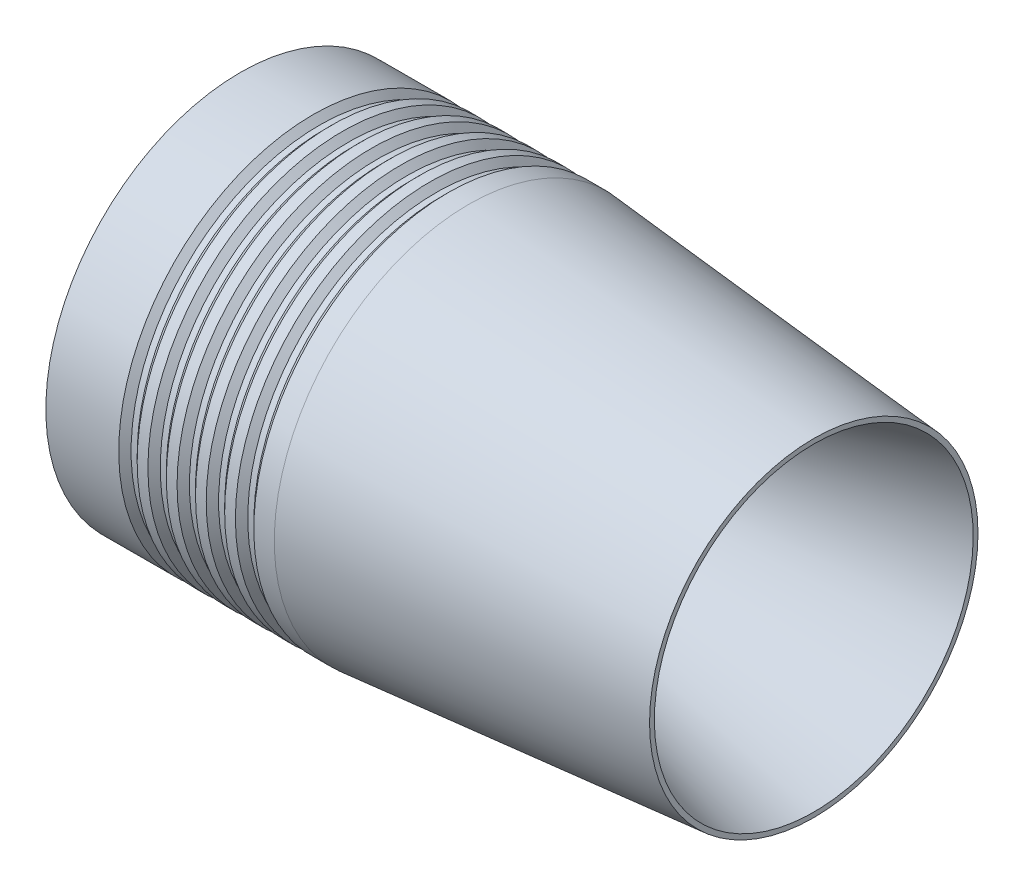
ISO-10303-21;
HEADER;
FILE_DESCRIPTION(('STEP AP214'),'2;1');
FILE_NAME('part.step','',(''),(''),'','','');
FILE_SCHEMA(('AUTOMOTIVE_DESIGN { 1 0 10303 214 1 1 1 1 }'));
ENDSEC;
DATA;
#1=APPLICATION_CONTEXT('core data for automotive mechanical design processes');
#2=APPLICATION_PROTOCOL_DEFINITION('international standard','automotive_design',2000,#1);
#3=PRODUCT_CONTEXT('',#1,'mechanical');
#4=PRODUCT('Part','Part','',(#3));
#5=PRODUCT_RELATED_PRODUCT_CATEGORY('part','',(#4));
#6=PRODUCT_DEFINITION_FORMATION('','',#4);
#7=PRODUCT_DEFINITION_CONTEXT('part definition',#1,'design');
#8=PRODUCT_DEFINITION('design','',#6,#7);
#9=PRODUCT_DEFINITION_SHAPE('','',#8);
#10=(LENGTH_UNIT() NAMED_UNIT(*) SI_UNIT(.MILLI.,.METRE.));
#11=(NAMED_UNIT(*) PLANE_ANGLE_UNIT() SI_UNIT($,.RADIAN.));
#12=(NAMED_UNIT(*) SI_UNIT($,.STERADIAN.) SOLID_ANGLE_UNIT());
#13=UNCERTAINTY_MEASURE_WITH_UNIT(LENGTH_MEASURE(1.E-05),#10,'distance_accuracy_value','');
#14=(GEOMETRIC_REPRESENTATION_CONTEXT(3) GLOBAL_UNCERTAINTY_ASSIGNED_CONTEXT((#13)) GLOBAL_UNIT_ASSIGNED_CONTEXT((#10,
#11,#12)) REPRESENTATION_CONTEXT('',''));
#15=CARTESIAN_POINT('',(0.,0.,0.));
#16=DIRECTION('',(0.,0.,1.));
#17=DIRECTION('',(1.,0.,0.));
#18=AXIS2_PLACEMENT_3D('',#15,#16,#17);
#19=CARTESIAN_POINT('',(0.,0.,0.));
#20=DIRECTION('',(1.,0.,0.));
#21=DIRECTION('',(0.,1.,0.));
#22=AXIS2_PLACEMENT_3D('',#19,#20,#21);
#23=CYLINDRICAL_SURFACE('',#22,50.8);
#24=CARTESIAN_POINT('',(-12.9667000000001,0.,0.));
#25=DIRECTION('',(1.,0.,0.));
#26=DIRECTION('',(0.,0.,-1.));
#27=AXIS2_PLACEMENT_3D('',#24,#25,#26);
#28=CIRCLE('',#27,50.8);
#29=CARTESIAN_POINT('',(-12.9667000000001,0.,-50.8));
#30=VERTEX_POINT('',#29);
#31=EDGE_CURVE('E133',#30,#30,#28,.T.);
#32=ORIENTED_EDGE('',*,*,#31,.T.);
#33=EDGE_LOOP('',(#32));
#34=FACE_BOUND('',#33,.T.);
#35=CARTESIAN_POINT('',(-10.16,0.,0.));
#36=DIRECTION('',(1.,0.,0.));
#37=DIRECTION('',(0.,0.,-1.));
#38=AXIS2_PLACEMENT_3D('',#35,#36,#37);
#39=CIRCLE('',#38,50.8);
#40=CARTESIAN_POINT('',(-10.16,0.,-50.8));
#41=VERTEX_POINT('',#40);
#42=EDGE_CURVE('E153',#41,#41,#39,.T.);
#43=ORIENTED_EDGE('',*,*,#42,.F.);
#44=EDGE_LOOP('',(#43));
#45=FACE_BOUND('',#44,.T.);
#46=ADVANCED_FACE('F41',(#34,#45),#23,.T.);
#47=CARTESIAN_POINT('',(-20.5867000000001,0.,0.));
#48=DIRECTION('',(1.,0.,0.));
#49=DIRECTION('',(0.,0.,-1.));
#50=AXIS2_PLACEMENT_3D('',#47,#48,#49);
#51=CIRCLE('',#50,50.8);
#52=CARTESIAN_POINT('',(-20.5867000000001,0.,-50.8));
#53=VERTEX_POINT('',#52);
#54=EDGE_CURVE('E117',#53,#53,#51,.T.);
#55=ORIENTED_EDGE('',*,*,#54,.T.);
#56=EDGE_LOOP('',(#55));
#57=FACE_BOUND('',#56,.T.);
#58=CARTESIAN_POINT('',(-17.78,0.,0.));
#59=DIRECTION('',(1.,0.,0.));
#60=DIRECTION('',(0.,0.,-1.));
#61=AXIS2_PLACEMENT_3D('',#58,#59,#60);
#62=CIRCLE('',#61,50.8);
#63=CARTESIAN_POINT('',(-17.78,0.,-50.8));
#64=VERTEX_POINT('',#63);
#65=EDGE_CURVE('E137',#64,#64,#62,.T.);
#66=ORIENTED_EDGE('',*,*,#65,.F.);
#67=EDGE_LOOP('',(#66));
#68=FACE_BOUND('',#67,.T.);
#69=ADVANCED_FACE('F179',(#57,#68),#23,.T.);
#70=CARTESIAN_POINT('',(-28.2067000000001,0.,0.));
#71=DIRECTION('',(1.,0.,0.));
#72=DIRECTION('',(0.,0.,-1.));
#73=AXIS2_PLACEMENT_3D('',#70,#71,#72);
#74=CIRCLE('',#73,50.8);
#75=CARTESIAN_POINT('',(-28.2067000000001,0.,-50.8));
#76=VERTEX_POINT('',#75);
#77=EDGE_CURVE('E101',#76,#76,#74,.T.);
#78=ORIENTED_EDGE('',*,*,#77,.T.);
#79=EDGE_LOOP('',(#78));
#80=FACE_BOUND('',#79,.T.);
#81=CARTESIAN_POINT('',(-25.4,0.,0.));
#82=DIRECTION('',(1.,0.,0.));
#83=DIRECTION('',(0.,0.,-1.));
#84=AXIS2_PLACEMENT_3D('',#81,#82,#83);
#85=CIRCLE('',#84,50.8);
#86=CARTESIAN_POINT('',(-25.4,0.,-50.8));
#87=VERTEX_POINT('',#86);
#88=EDGE_CURVE('E121',#87,#87,#85,.T.);
#89=ORIENTED_EDGE('',*,*,#88,.F.);
#90=EDGE_LOOP('',(#89));
#91=FACE_BOUND('',#90,.T.);
#92=ADVANCED_FACE('F185',(#80,#91),#23,.T.);
#93=CARTESIAN_POINT('',(-35.8267000000001,0.,0.));
#94=DIRECTION('',(1.,0.,0.));
#95=DIRECTION('',(0.,0.,-1.));
#96=AXIS2_PLACEMENT_3D('',#93,#94,#95);
#97=CIRCLE('',#96,50.8);
#98=CARTESIAN_POINT('',(-35.8267000000001,0.,-50.8));
#99=VERTEX_POINT('',#98);
#100=EDGE_CURVE('E85',#99,#99,#97,.T.);
#101=ORIENTED_EDGE('',*,*,#100,.T.);
#102=EDGE_LOOP('',(#101));
#103=FACE_BOUND('',#102,.T.);
#104=CARTESIAN_POINT('',(-33.02,0.,0.));
#105=DIRECTION('',(1.,0.,0.));
#106=DIRECTION('',(0.,0.,-1.));
#107=AXIS2_PLACEMENT_3D('',#104,#105,#106);
#108=CIRCLE('',#107,50.8);
#109=CARTESIAN_POINT('',(-33.02,0.,-50.8));
#110=VERTEX_POINT('',#109);
#111=EDGE_CURVE('E105',#110,#110,#108,.T.);
#112=ORIENTED_EDGE('',*,*,#111,.F.);
#113=EDGE_LOOP('',(#112));
#114=FACE_BOUND('',#113,.T.);
#115=ADVANCED_FACE('F202',(#103,#114),#23,.T.);
#116=CARTESIAN_POINT('',(-59.69,0.,0.));
#117=DIRECTION('',(1.,0.,0.));
#118=DIRECTION('',(0.,1.,0.));
#119=AXIS2_PLACEMENT_3D('',#116,#117,#118);
#120=CIRCLE('',#119,50.8);
#121=CARTESIAN_POINT('',(-59.69,50.8,0.));
#122=VERTEX_POINT('',#121);
#123=EDGE_CURVE('E50',#122,#122,#120,.T.);
#124=ORIENTED_EDGE('',*,*,#123,.T.);
#125=EDGE_LOOP('',(#124));
#126=FACE_BOUND('',#125,.T.);
#127=CARTESIAN_POINT('',(-40.64,0.,0.));
#128=DIRECTION('',(1.,0.,0.));
#129=DIRECTION('',(0.,0.,-1.));
#130=AXIS2_PLACEMENT_3D('',#127,#128,#129);
#131=CIRCLE('',#130,50.8);
#132=CARTESIAN_POINT('',(-40.64,0.,-50.8));
#133=VERTEX_POINT('',#132);
#134=EDGE_CURVE('E89',#133,#133,#131,.T.);
#135=ORIENTED_EDGE('',*,*,#134,.F.);
#136=EDGE_LOOP('',(#135));
#137=FACE_BOUND('',#136,.T.);
#138=ADVANCED_FACE('F192',(#126,#137),#23,.T.);
#139=CARTESIAN_POINT('',(0.,0.,0.));
#140=DIRECTION('',(-1.,0.,0.));
#141=DIRECTION('',(0.,-1.,0.));
#142=AXIS2_PLACEMENT_3D('',#139,#140,#141);
#143=CONICAL_SURFACE('',#142,50.8,0.0872664625997168);
#144=CARTESIAN_POINT('',(90.17,0.,0.));
#145=DIRECTION('',(1.,0.,0.));
#146=DIRECTION('',(0.,1.,0.));
#147=AXIS2_PLACEMENT_3D('',#144,#145,#146);
#148=CIRCLE('',#147,42.9111472098674);
#149=CARTESIAN_POINT('',(90.17,42.9111472098674,0.));
#150=VERTEX_POINT('',#149);
#151=EDGE_CURVE('E61',#150,#150,#148,.T.);
#152=ORIENTED_EDGE('',*,*,#151,.F.);
#153=EDGE_LOOP('',(#152));
#154=FACE_BOUND('',#153,.T.);
#155=CARTESIAN_POINT('',(0.,0.,0.));
#156=DIRECTION('',(1.,0.,0.));
#157=DIRECTION('',(0.,1.,0.));
#158=AXIS2_PLACEMENT_3D('',#155,#156,#157);
#159=CIRCLE('',#158,50.8);
#160=CARTESIAN_POINT('',(0.,50.8,0.));
#161=VERTEX_POINT('',#160);
#162=EDGE_CURVE('E10',#161,#161,#159,.T.);
#163=ORIENTED_EDGE('',*,*,#162,.T.);
#164=EDGE_LOOP('',(#163));
#165=FACE_BOUND('',#164,.T.);
#166=ADVANCED_FACE('F43',(#154,#165),#143,.T.);
#167=CARTESIAN_POINT('',(-5.34670000000008,0.,0.));
#168=DIRECTION('',(1.,0.,0.));
#169=DIRECTION('',(0.,0.,-1.));
#170=AXIS2_PLACEMENT_3D('',#167,#168,#169);
#171=CIRCLE('',#170,50.8);
#172=CARTESIAN_POINT('',(-5.34670000000008,0.,-50.8));
#173=VERTEX_POINT('',#172);
#174=EDGE_CURVE('E149',#173,#173,#171,.T.);
#175=ORIENTED_EDGE('',*,*,#174,.T.);
#176=EDGE_LOOP('',(#175));
#177=FACE_BOUND('',#176,.T.);
#178=ORIENTED_EDGE('',*,*,#162,.F.);
#179=EDGE_LOOP('',(#178));
#180=FACE_BOUND('',#179,.T.);
#181=ADVANCED_FACE('F181',(#177,#180),#23,.T.);
#182=CARTESIAN_POINT('',(-59.69,0.,0.));
#183=DIRECTION('',(1.,0.,0.));
#184=DIRECTION('',(0.,1.,0.));
#185=AXIS2_PLACEMENT_3D('',#182,#183,#184);
#186=PLANE('',#185);
#187=ORIENTED_EDGE('',*,*,#123,.F.);
#188=EDGE_LOOP('',(#187));
#189=FACE_BOUND('',#188,.T.);
#190=CARTESIAN_POINT('',(-59.69,0.,0.));
#191=DIRECTION('',(1.,0.,0.));
#192=DIRECTION('',(0.,1.,0.));
#193=AXIS2_PLACEMENT_3D('',#190,#191,#192);
#194=CIRCLE('',#193,44.45);
#195=CARTESIAN_POINT('',(-59.69,44.45,0.));
#196=VERTEX_POINT('',#195);
#197=EDGE_CURVE('E73',#196,#196,#194,.T.);
#198=ORIENTED_EDGE('',*,*,#197,.T.);
#199=EDGE_LOOP('',(#198));
#200=FACE_BOUND('',#199,.T.);
#201=ADVANCED_FACE('F190',(#189,#200),#186,.F.);
#202=CARTESIAN_POINT('',(1.78084856857237,0.,0.));
#203=DIRECTION('',(1.,0.,0.));
#204=DIRECTION('',(0.,1.,0.));
#205=AXIS2_PLACEMENT_3D('',#202,#203,#204);
#206=CONICAL_SURFACE('',#205,17.8882556763972,0.262685253079923);
#207=CARTESIAN_POINT('',(25.4,0.,0.));
#208=DIRECTION('',(1.,0.,0.));
#209=DIRECTION('',(0.,1.,0.));
#210=AXIS2_PLACEMENT_3D('',#207,#208,#209);
#211=CIRCLE('',#210,24.2394191763448);
#212=CARTESIAN_POINT('',(25.4,24.2394191763448,0.));
#213=VERTEX_POINT('',#212);
#214=EDGE_CURVE('E45',#213,#213,#211,.T.);
#215=ORIENTED_EDGE('',*,*,#214,.F.);
#216=EDGE_LOOP('',(#215));
#217=FACE_BOUND('',#216,.T.);
#218=CARTESIAN_POINT('',(90.17,0.,0.));
#219=DIRECTION('',(1.,0.,0.));
#220=DIRECTION('',(0.,1.,0.));
#221=AXIS2_PLACEMENT_3D('',#218,#219,#220);
#222=CIRCLE('',#221,41.656);
#223=CARTESIAN_POINT('',(90.17,41.656,0.));
#224=VERTEX_POINT('',#223);
#225=EDGE_CURVE('E55',#224,#224,#222,.T.);
#226=ORIENTED_EDGE('',*,*,#225,.T.);
#227=EDGE_LOOP('',(#226));
#228=FACE_BOUND('',#227,.T.);
#229=ADVANCED_FACE('F197',(#217,#228),#206,.F.);
#230=CARTESIAN_POINT('',(90.17,0.,0.));
#231=DIRECTION('',(1.,0.,0.));
#232=DIRECTION('',(0.,1.,0.));
#233=AXIS2_PLACEMENT_3D('',#230,#231,#232);
#234=PLANE('',#233);
#235=ORIENTED_EDGE('',*,*,#151,.T.);
#236=EDGE_LOOP('',(#235));
#237=FACE_BOUND('',#236,.T.);
#238=ORIENTED_EDGE('',*,*,#225,.F.);
#239=EDGE_LOOP('',(#238));
#240=FACE_BOUND('',#239,.T.);
#241=ADVANCED_FACE('F252',(#237,#240),#234,.T.);
#242=CARTESIAN_POINT('',(25.4,0.,0.));
#243=DIRECTION('',(1.,0.,0.));
#244=DIRECTION('',(0.,1.,0.));
#245=AXIS2_PLACEMENT_3D('',#242,#243,#244);
#246=PLANE('',#245);
#247=ORIENTED_EDGE('',*,*,#214,.T.);
#248=EDGE_LOOP('',(#247));
#249=FACE_BOUND('',#248,.T.);
#250=CARTESIAN_POINT('',(25.4,0.,0.));
#251=DIRECTION('',(-1.,0.,0.));
#252=DIRECTION('',(0.,-1.,0.));
#253=AXIS2_PLACEMENT_3D('',#250,#251,#252);
#254=CIRCLE('',#253,31.75);
#255=CARTESIAN_POINT('',(25.4,-31.75,0.));
#256=VERTEX_POINT('',#255);
#257=EDGE_CURVE('E65',#256,#256,#254,.T.);
#258=ORIENTED_EDGE('',*,*,#257,.T.);
#259=EDGE_LOOP('',(#258));
#260=FACE_BOUND('',#259,.T.);
#261=ADVANCED_FACE('F248',(#249,#260),#246,.F.);
#262=CARTESIAN_POINT('',(-29.0855384380722,0.,0.));
#263=DIRECTION('',(-1.,0.,0.));
#264=DIRECTION('',(0.,-1.,0.));
#265=AXIS2_PLACEMENT_3D('',#262,#263,#264);
#266=CONICAL_SURFACE('',#265,35.56,0.0698131700797735);
#267=ORIENTED_EDGE('',*,*,#257,.F.);
#268=EDGE_LOOP('',(#267));
#269=FACE_BOUND('',#268,.T.);
#270=CARTESIAN_POINT('',(-29.0855384380722,0.,0.));
#271=DIRECTION('',(-1.,0.,0.));
#272=DIRECTION('',(0.,-1.,0.));
#273=AXIS2_PLACEMENT_3D('',#270,#271,#272);
#274=CIRCLE('',#273,35.56);
#275=CARTESIAN_POINT('',(-29.0855384380722,-35.56,0.));
#276=VERTEX_POINT('',#275);
#277=EDGE_CURVE('E69',#276,#276,#274,.T.);
#278=ORIENTED_EDGE('',*,*,#277,.T.);
#279=EDGE_LOOP('',(#278));
#280=FACE_BOUND('',#279,.T.);
#281=ADVANCED_FACE('F244',(#269,#280),#266,.F.);
#282=CARTESIAN_POINT('',(-50.8,0.,0.));
#283=DIRECTION('',(-1.,0.,0.));
#284=DIRECTION('',(0.,-1.,0.));
#285=AXIS2_PLACEMENT_3D('',#282,#283,#284);
#286=CYLINDRICAL_SURFACE('',#285,35.56);
#287=ORIENTED_EDGE('',*,*,#277,.F.);
#288=EDGE_LOOP('',(#287));
#289=FACE_BOUND('',#288,.T.);
#290=CARTESIAN_POINT('',(-42.6454767554289,0.,0.));
#291=DIRECTION('',(1.,0.,0.));
#292=DIRECTION('',(0.,1.,0.));
#293=AXIS2_PLACEMENT_3D('',#290,#291,#292);
#294=CIRCLE('',#293,35.56);
#295=CARTESIAN_POINT('',(-42.6454767554289,35.56,0.));
#296=VERTEX_POINT('',#295);
#297=EDGE_CURVE('E77',#296,#296,#294,.F.);
#298=ORIENTED_EDGE('',*,*,#297,.T.);
#299=EDGE_LOOP('',(#298));
#300=FACE_BOUND('',#299,.T.);
#301=ADVANCED_FACE('F239',(#289,#300),#286,.F.);
#302=CARTESIAN_POINT('',(0.,0.,0.));
#303=DIRECTION('',(1.,0.,0.));
#304=DIRECTION('',(0.,1.,0.));
#305=AXIS2_PLACEMENT_3D('',#302,#303,#304);
#306=CYLINDRICAL_SURFACE('',#305,44.45);
#307=CARTESIAN_POINT('',(-42.6454767554289,0.,0.));
#308=DIRECTION('',(1.,0.,0.));
#309=DIRECTION('',(0.,1.,0.));
#310=AXIS2_PLACEMENT_3D('',#307,#308,#309);
#311=CIRCLE('',#310,44.45);
#312=CARTESIAN_POINT('',(-42.6454767554289,44.45,0.));
#313=VERTEX_POINT('',#312);
#314=EDGE_CURVE('E81',#313,#313,#311,.T.);
#315=ORIENTED_EDGE('',*,*,#314,.T.);
#316=EDGE_LOOP('',(#315));
#317=FACE_BOUND('',#316,.T.);
#318=ORIENTED_EDGE('',*,*,#197,.F.);
#319=EDGE_LOOP('',(#318));
#320=FACE_BOUND('',#319,.T.);
#321=ADVANCED_FACE('F233',(#317,#320),#306,.F.);
#322=CARTESIAN_POINT('',(-42.6454767554289,31.75,0.));
#323=DIRECTION('',(1.,0.,0.));
#324=DIRECTION('',(0.,1.,0.));
#325=AXIS2_PLACEMENT_3D('',#322,#323,#324);
#326=PLANE('',#325);
#327=ORIENTED_EDGE('',*,*,#314,.F.);
#328=EDGE_LOOP('',(#327));
#329=FACE_BOUND('',#328,.T.);
#330=ORIENTED_EDGE('',*,*,#297,.F.);
#331=EDGE_LOOP('',(#330));
#332=FACE_BOUND('',#331,.T.);
#333=ADVANCED_FACE('F227',(#329,#332),#326,.F.);
#334=CARTESIAN_POINT('',(-37.4396,0.,0.));
#335=DIRECTION('',(1.,0.,0.));
#336=DIRECTION('',(0.,0.,-1.));
#337=AXIS2_PLACEMENT_3D('',#334,#335,#336);
#338=CONICAL_SURFACE('',#337,49.1871,0.785398163397457);
#339=ORIENTED_EDGE('',*,*,#100,.F.);
#340=EDGE_LOOP('',(#339));
#341=FACE_BOUND('',#340,.T.);
#342=CARTESIAN_POINT('',(-37.4396,0.,0.));
#343=DIRECTION('',(1.,0.,0.));
#344=DIRECTION('',(0.,0.,-1.));
#345=AXIS2_PLACEMENT_3D('',#342,#343,#344);
#346=CIRCLE('',#345,49.1871);
#347=CARTESIAN_POINT('',(-37.4396,0.,-49.1871));
#348=VERTEX_POINT('',#347);
#349=EDGE_CURVE('E97',#348,#348,#346,.T.);
#350=ORIENTED_EDGE('',*,*,#349,.T.);
#351=EDGE_LOOP('',(#350));
#352=FACE_BOUND('',#351,.T.);
#353=ADVANCED_FACE('F216',(#341,#352),#338,.T.);
#354=CARTESIAN_POINT('',(-39.0271,0.,0.));
#355=DIRECTION('',(-1.,0.,0.));
#356=DIRECTION('',(0.,0.,1.));
#357=AXIS2_PLACEMENT_3D('',#354,#355,#356);
#358=CONICAL_SURFACE('',#357,49.1871,0.78539816339745);
#359=ORIENTED_EDGE('',*,*,#134,.T.);
#360=EDGE_LOOP('',(#359));
#361=FACE_BOUND('',#360,.T.);
#362=CARTESIAN_POINT('',(-39.0271,0.,0.));
#363=DIRECTION('',(1.,0.,0.));
#364=DIRECTION('',(0.,0.,-1.));
#365=AXIS2_PLACEMENT_3D('',#362,#363,#364);
#366=CIRCLE('',#365,49.1871);
#367=CARTESIAN_POINT('',(-39.0271,0.,-49.1871));
#368=VERTEX_POINT('',#367);
#369=EDGE_CURVE('E93',#368,#368,#366,.T.);
#370=ORIENTED_EDGE('',*,*,#369,.F.);
#371=EDGE_LOOP('',(#370));
#372=FACE_BOUND('',#371,.T.);
#373=ADVANCED_FACE('F212',(#361,#372),#358,.T.);
#374=CARTESIAN_POINT('',(0.,0.,0.));
#375=DIRECTION('',(1.,0.,0.));
#376=DIRECTION('',(0.,0.,-1.));
#377=AXIS2_PLACEMENT_3D('',#374,#375,#376);
#378=CYLINDRICAL_SURFACE('',#377,49.1871);
#379=ORIENTED_EDGE('',*,*,#369,.T.);
#380=EDGE_LOOP('',(#379));
#381=FACE_BOUND('',#380,.T.);
#382=ORIENTED_EDGE('',*,*,#349,.F.);
#383=EDGE_LOOP('',(#382));
#384=FACE_BOUND('',#383,.T.);
#385=ADVANCED_FACE('F215',(#381,#384),#378,.T.);
#386=CARTESIAN_POINT('',(-29.8196,0.,0.));
#387=DIRECTION('',(1.,0.,0.));
#388=DIRECTION('',(0.,0.,-1.));
#389=AXIS2_PLACEMENT_3D('',#386,#387,#388);
#390=CONICAL_SURFACE('',#389,49.1871,0.785398163397457);
#391=ORIENTED_EDGE('',*,*,#77,.F.);
#392=EDGE_LOOP('',(#391));
#393=FACE_BOUND('',#392,.T.);
#394=CARTESIAN_POINT('',(-29.8196,0.,0.));
#395=DIRECTION('',(1.,0.,0.));
#396=DIRECTION('',(0.,0.,-1.));
#397=AXIS2_PLACEMENT_3D('',#394,#395,#396);
#398=CIRCLE('',#397,49.1871);
#399=CARTESIAN_POINT('',(-29.8196,0.,-49.1871));
#400=VERTEX_POINT('',#399);
#401=EDGE_CURVE('E113',#400,#400,#398,.T.);
#402=ORIENTED_EDGE('',*,*,#401,.T.);
#403=EDGE_LOOP('',(#402));
#404=FACE_BOUND('',#403,.T.);
#405=ADVANCED_FACE('F222',(#393,#404),#390,.T.);
#406=CARTESIAN_POINT('',(-31.4071,0.,0.));
#407=DIRECTION('',(-1.,0.,0.));
#408=DIRECTION('',(0.,0.,1.));
#409=AXIS2_PLACEMENT_3D('',#406,#407,#408);
#410=CONICAL_SURFACE('',#409,49.1871,0.78539816339745);
#411=ORIENTED_EDGE('',*,*,#111,.T.);
#412=EDGE_LOOP('',(#411));
#413=FACE_BOUND('',#412,.T.);
#414=CARTESIAN_POINT('',(-31.4071,0.,0.));
#415=DIRECTION('',(1.,0.,0.));
#416=DIRECTION('',(0.,0.,-1.));
#417=AXIS2_PLACEMENT_3D('',#414,#415,#416);
#418=CIRCLE('',#417,49.1871);
#419=CARTESIAN_POINT('',(-31.4071,0.,-49.1871));
#420=VERTEX_POINT('',#419);
#421=EDGE_CURVE('E109',#420,#420,#418,.T.);
#422=ORIENTED_EDGE('',*,*,#421,.F.);
#423=EDGE_LOOP('',(#422));
#424=FACE_BOUND('',#423,.T.);
#425=ADVANCED_FACE('F360',(#413,#424),#410,.T.);
#426=CARTESIAN_POINT('',(7.62,0.,0.));
#427=DIRECTION('',(1.,0.,0.));
#428=DIRECTION('',(0.,0.,-1.));
#429=AXIS2_PLACEMENT_3D('',#426,#427,#428);
#430=CYLINDRICAL_SURFACE('',#429,49.1871);
#431=ORIENTED_EDGE('',*,*,#421,.T.);
#432=EDGE_LOOP('',(#431));
#433=FACE_BOUND('',#432,.T.);
#434=ORIENTED_EDGE('',*,*,#401,.F.);
#435=EDGE_LOOP('',(#434));
#436=FACE_BOUND('',#435,.T.);
#437=ADVANCED_FACE('F369',(#433,#436),#430,.T.);
#438=CARTESIAN_POINT('',(-22.1996,0.,0.));
#439=DIRECTION('',(1.,0.,0.));
#440=DIRECTION('',(0.,0.,-1.));
#441=AXIS2_PLACEMENT_3D('',#438,#439,#440);
#442=CONICAL_SURFACE('',#441,49.1871,0.785398163397457);
#443=ORIENTED_EDGE('',*,*,#54,.F.);
#444=EDGE_LOOP('',(#443));
#445=FACE_BOUND('',#444,.T.);
#446=CARTESIAN_POINT('',(-22.1996,0.,0.));
#447=DIRECTION('',(1.,0.,0.));
#448=DIRECTION('',(0.,0.,-1.));
#449=AXIS2_PLACEMENT_3D('',#446,#447,#448);
#450=CIRCLE('',#449,49.1871);
#451=CARTESIAN_POINT('',(-22.1996,0.,-49.1871));
#452=VERTEX_POINT('',#451);
#453=EDGE_CURVE('E129',#452,#452,#450,.T.);
#454=ORIENTED_EDGE('',*,*,#453,.T.);
#455=EDGE_LOOP('',(#454));
#456=FACE_BOUND('',#455,.T.);
#457=ADVANCED_FACE('F378',(#445,#456),#442,.T.);
#458=CARTESIAN_POINT('',(-23.7871,0.,0.));
#459=DIRECTION('',(-1.,0.,0.));
#460=DIRECTION('',(0.,0.,1.));
#461=AXIS2_PLACEMENT_3D('',#458,#459,#460);
#462=CONICAL_SURFACE('',#461,49.1871,0.78539816339745);
#463=ORIENTED_EDGE('',*,*,#88,.T.);
#464=EDGE_LOOP('',(#463));
#465=FACE_BOUND('',#464,.T.);
#466=CARTESIAN_POINT('',(-23.7871,0.,0.));
#467=DIRECTION('',(1.,0.,0.));
#468=DIRECTION('',(0.,0.,-1.));
#469=AXIS2_PLACEMENT_3D('',#466,#467,#468);
#470=CIRCLE('',#469,49.1871);
#471=CARTESIAN_POINT('',(-23.7871,0.,-49.1871));
#472=VERTEX_POINT('',#471);
#473=EDGE_CURVE('E125',#472,#472,#470,.T.);
#474=ORIENTED_EDGE('',*,*,#473,.F.);
#475=EDGE_LOOP('',(#474));
#476=FACE_BOUND('',#475,.T.);
#477=ADVANCED_FACE('F387',(#465,#476),#462,.T.);
#478=CARTESIAN_POINT('',(15.24,0.,0.));
#479=DIRECTION('',(1.,0.,0.));
#480=DIRECTION('',(0.,0.,-1.));
#481=AXIS2_PLACEMENT_3D('',#478,#479,#480);
#482=CYLINDRICAL_SURFACE('',#481,49.1871);
#483=ORIENTED_EDGE('',*,*,#473,.T.);
#484=EDGE_LOOP('',(#483));
#485=FACE_BOUND('',#484,.T.);
#486=ORIENTED_EDGE('',*,*,#453,.F.);
#487=EDGE_LOOP('',(#486));
#488=FACE_BOUND('',#487,.T.);
#489=ADVANCED_FACE('F397',(#485,#488),#482,.T.);
#490=CARTESIAN_POINT('',(-14.5796,0.,0.));
#491=DIRECTION('',(1.,0.,0.));
#492=DIRECTION('',(0.,0.,-1.));
#493=AXIS2_PLACEMENT_3D('',#490,#491,#492);
#494=CONICAL_SURFACE('',#493,49.1871,0.785398163397457);
#495=ORIENTED_EDGE('',*,*,#31,.F.);
#496=EDGE_LOOP('',(#495));
#497=FACE_BOUND('',#496,.T.);
#498=CARTESIAN_POINT('',(-14.5796,0.,0.));
#499=DIRECTION('',(1.,0.,0.));
#500=DIRECTION('',(0.,0.,-1.));
#501=AXIS2_PLACEMENT_3D('',#498,#499,#500);
#502=CIRCLE('',#501,49.1871);
#503=CARTESIAN_POINT('',(-14.5796,0.,-49.1871));
#504=VERTEX_POINT('',#503);
#505=EDGE_CURVE('E145',#504,#504,#502,.T.);
#506=ORIENTED_EDGE('',*,*,#505,.T.);
#507=EDGE_LOOP('',(#506));
#508=FACE_BOUND('',#507,.T.);
#509=ADVANCED_FACE('F407',(#497,#508),#494,.T.);
#510=CARTESIAN_POINT('',(-16.1671,0.,0.));
#511=DIRECTION('',(-1.,0.,0.));
#512=DIRECTION('',(0.,0.,1.));
#513=AXIS2_PLACEMENT_3D('',#510,#511,#512);
#514=CONICAL_SURFACE('',#513,49.1871,0.78539816339745);
#515=ORIENTED_EDGE('',*,*,#65,.T.);
#516=EDGE_LOOP('',(#515));
#517=FACE_BOUND('',#516,.T.);
#518=CARTESIAN_POINT('',(-16.1671,0.,0.));
#519=DIRECTION('',(1.,0.,0.));
#520=DIRECTION('',(0.,0.,-1.));
#521=AXIS2_PLACEMENT_3D('',#518,#519,#520);
#522=CIRCLE('',#521,49.1871);
#523=CARTESIAN_POINT('',(-16.1671,0.,-49.1871));
#524=VERTEX_POINT('',#523);
#525=EDGE_CURVE('E141',#524,#524,#522,.T.);
#526=ORIENTED_EDGE('',*,*,#525,.F.);
#527=EDGE_LOOP('',(#526));
#528=FACE_BOUND('',#527,.T.);
#529=ADVANCED_FACE('F417',(#517,#528),#514,.T.);
#530=CARTESIAN_POINT('',(22.86,0.,0.));
#531=DIRECTION('',(1.,0.,0.));
#532=DIRECTION('',(0.,0.,-1.));
#533=AXIS2_PLACEMENT_3D('',#530,#531,#532);
#534=CYLINDRICAL_SURFACE('',#533,49.1871);
#535=ORIENTED_EDGE('',*,*,#525,.T.);
#536=EDGE_LOOP('',(#535));
#537=FACE_BOUND('',#536,.T.);
#538=ORIENTED_EDGE('',*,*,#505,.F.);
#539=EDGE_LOOP('',(#538));
#540=FACE_BOUND('',#539,.T.);
#541=ADVANCED_FACE('F427',(#537,#540),#534,.T.);
#542=CARTESIAN_POINT('',(-6.95960000000005,0.,0.));
#543=DIRECTION('',(1.,0.,0.));
#544=DIRECTION('',(0.,0.,-1.));
#545=AXIS2_PLACEMENT_3D('',#542,#543,#544);
#546=CONICAL_SURFACE('',#545,49.1871,0.785398163397457);
#547=ORIENTED_EDGE('',*,*,#174,.F.);
#548=EDGE_LOOP('',(#547));
#549=FACE_BOUND('',#548,.T.);
#550=CARTESIAN_POINT('',(-6.95960000000005,0.,0.));
#551=DIRECTION('',(1.,0.,0.));
#552=DIRECTION('',(0.,0.,-1.));
#553=AXIS2_PLACEMENT_3D('',#550,#551,#552);
#554=CIRCLE('',#553,49.1871);
#555=CARTESIAN_POINT('',(-6.95960000000005,0.,-49.1871));
#556=VERTEX_POINT('',#555);
#557=EDGE_CURVE('E161',#556,#556,#554,.T.);
#558=ORIENTED_EDGE('',*,*,#557,.T.);
#559=EDGE_LOOP('',(#558));
#560=FACE_BOUND('',#559,.T.);
#561=ADVANCED_FACE('F166',(#549,#560),#546,.T.);
#562=CARTESIAN_POINT('',(-8.54710000000002,0.,0.));
#563=DIRECTION('',(-1.,0.,0.));
#564=DIRECTION('',(0.,0.,1.));
#565=AXIS2_PLACEMENT_3D('',#562,#563,#564);
#566=CONICAL_SURFACE('',#565,49.1871,0.78539816339745);
#567=ORIENTED_EDGE('',*,*,#42,.T.);
#568=EDGE_LOOP('',(#567));
#569=FACE_BOUND('',#568,.T.);
#570=CARTESIAN_POINT('',(-8.54710000000002,0.,0.));
#571=DIRECTION('',(1.,0.,0.));
#572=DIRECTION('',(0.,0.,-1.));
#573=AXIS2_PLACEMENT_3D('',#570,#571,#572);
#574=CIRCLE('',#573,49.1871);
#575=CARTESIAN_POINT('',(-8.54710000000002,0.,-49.1871));
#576=VERTEX_POINT('',#575);
#577=EDGE_CURVE('E157',#576,#576,#574,.T.);
#578=ORIENTED_EDGE('',*,*,#577,.F.);
#579=EDGE_LOOP('',(#578));
#580=FACE_BOUND('',#579,.T.);
#581=ADVANCED_FACE('F170',(#569,#580),#566,.T.);
#582=CARTESIAN_POINT('',(30.48,0.,0.));
#583=DIRECTION('',(1.,0.,0.));
#584=DIRECTION('',(0.,0.,-1.));
#585=AXIS2_PLACEMENT_3D('',#582,#583,#584);
#586=CYLINDRICAL_SURFACE('',#585,49.1871);
#587=ORIENTED_EDGE('',*,*,#577,.T.);
#588=EDGE_LOOP('',(#587));
#589=FACE_BOUND('',#588,.T.);
#590=ORIENTED_EDGE('',*,*,#557,.F.);
#591=EDGE_LOOP('',(#590));
#592=FACE_BOUND('',#591,.T.);
#593=ADVANCED_FACE('F168',(#589,#592),#586,.T.);
#594=CLOSED_SHELL('',(#46,#69,#92,#115,#138,#166,#181,#201,#229,#241,#261,#281,#301,#321,#333,
#353,#373,#385,#405,#425,#437,#457,#477,#489,#509,#529,#541,#561,#581,#593));
#595=MANIFOLD_SOLID_BREP('B2',#594);
#596=ADVANCED_BREP_SHAPE_REPRESENTATION('',(#18,#595),#14);
#597=SHAPE_DEFINITION_REPRESENTATION(#9,#596);
ENDSEC;
END-ISO-10303-21;
